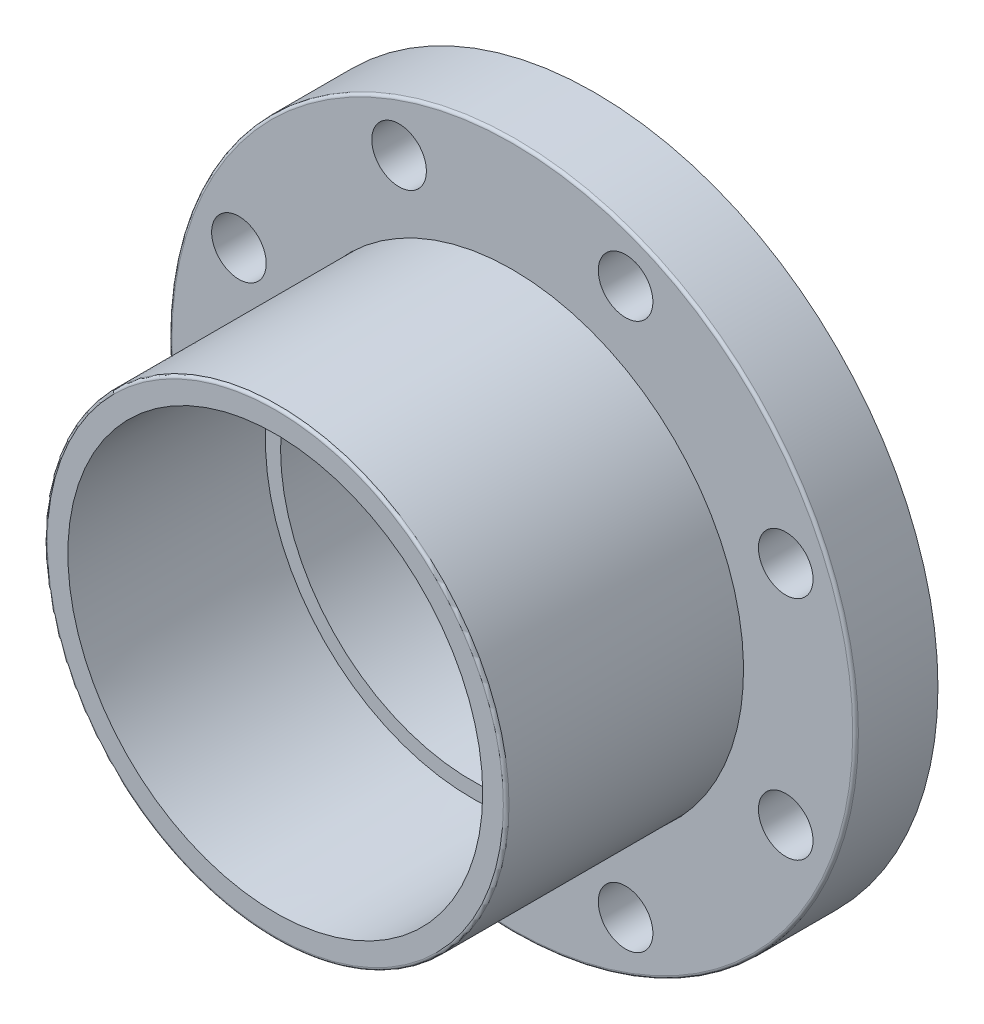
ISO-10303-21;
HEADER;
FILE_DESCRIPTION(('STEP AP214'),'2;1');
FILE_NAME('part.step','',(''),(''),'','','');
FILE_SCHEMA(('AUTOMOTIVE_DESIGN { 1 0 10303 214 1 1 1 1 }'));
ENDSEC;
DATA;
#1=APPLICATION_CONTEXT('core data for automotive mechanical design processes');
#2=APPLICATION_PROTOCOL_DEFINITION('international standard','automotive_design',2000,#1);
#3=PRODUCT_CONTEXT('',#1,'mechanical');
#4=PRODUCT('Part','Part','',(#3));
#5=PRODUCT_RELATED_PRODUCT_CATEGORY('part','',(#4));
#6=PRODUCT_DEFINITION_FORMATION('','',#4);
#7=PRODUCT_DEFINITION_CONTEXT('part definition',#1,'design');
#8=PRODUCT_DEFINITION('design','',#6,#7);
#9=PRODUCT_DEFINITION_SHAPE('','',#8);
#10=(LENGTH_UNIT() NAMED_UNIT(*) SI_UNIT(.MILLI.,.METRE.));
#11=(NAMED_UNIT(*) PLANE_ANGLE_UNIT() SI_UNIT($,.RADIAN.));
#12=(NAMED_UNIT(*) SI_UNIT($,.STERADIAN.) SOLID_ANGLE_UNIT());
#13=UNCERTAINTY_MEASURE_WITH_UNIT(LENGTH_MEASURE(1.E-05),#10,'distance_accuracy_value','');
#14=(GEOMETRIC_REPRESENTATION_CONTEXT(3) GLOBAL_UNCERTAINTY_ASSIGNED_CONTEXT((#13)) GLOBAL_UNIT_ASSIGNED_CONTEXT((#10,
#11,#12)) REPRESENTATION_CONTEXT('',''));
#15=CARTESIAN_POINT('',(0.,0.,0.));
#16=DIRECTION('',(0.,0.,1.));
#17=DIRECTION('',(1.,0.,0.));
#18=AXIS2_PLACEMENT_3D('',#15,#16,#17);
#19=CARTESIAN_POINT('',(0.,0.,0.));
#20=DIRECTION('',(0.,0.,-1.));
#21=DIRECTION('',(0.,1.,0.));
#22=AXIS2_PLACEMENT_3D('',#19,#20,#21);
#23=CYLINDRICAL_SURFACE('',#22,94.107);
#24=CARTESIAN_POINT('',(0.,0.,16.0597272727273));
#25=DIRECTION('',(0.,0.,-1.));
#26=DIRECTION('',(0.,1.,0.));
#27=AXIS2_PLACEMENT_3D('',#24,#25,#26);
#28=CIRCLE('',#27,94.107);
#29=CARTESIAN_POINT('',(0.,94.107,16.0597272727273));
#30=VERTEX_POINT('',#29);
#31=EDGE_CURVE('E63',#30,#30,#28,.T.);
#32=ORIENTED_EDGE('',*,*,#31,.T.);
#33=EDGE_LOOP('',(#32));
#34=FACE_BOUND('',#33,.T.);
#35=CARTESIAN_POINT('',(0.,0.,33.528));
#36=DIRECTION('',(0.,0.,-1.));
#37=DIRECTION('',(0.,1.,0.));
#38=AXIS2_PLACEMENT_3D('',#35,#36,#37);
#39=CIRCLE('',#38,94.107);
#40=CARTESIAN_POINT('',(0.,94.107,33.528));
#41=VERTEX_POINT('',#40);
#42=EDGE_CURVE('E58',#41,#41,#39,.T.);
#43=ORIENTED_EDGE('',*,*,#42,.F.);
#44=EDGE_LOOP('',(#43));
#45=FACE_BOUND('',#44,.T.);
#46=ADVANCED_FACE('F40',(#34,#45),#23,.F.);
#47=CARTESIAN_POINT('',(0.,93.98,16.0597272727273));
#48=DIRECTION('',(0.,0.,1.));
#49=DIRECTION('',(0.,-1.,0.));
#50=AXIS2_PLACEMENT_3D('',#47,#48,#49);
#51=PLANE('',#50);
#52=CARTESIAN_POINT('',(0.,0.,16.0597272727273));
#53=DIRECTION('',(0.,0.,-1.));
#54=DIRECTION('',(0.,1.,0.));
#55=AXIS2_PLACEMENT_3D('',#52,#53,#54);
#56=CIRCLE('',#55,82.9720098336647);
#57=CARTESIAN_POINT('',(0.,82.9720098336647,16.0597272727273));
#58=VERTEX_POINT('',#57);
#59=EDGE_CURVE('E65',#58,#58,#56,.T.);
#60=ORIENTED_EDGE('',*,*,#59,.T.);
#61=EDGE_LOOP('',(#60));
#62=FACE_BOUND('',#61,.T.);
#63=ORIENTED_EDGE('',*,*,#31,.F.);
#64=EDGE_LOOP('',(#63));
#65=FACE_BOUND('',#64,.T.);
#66=ADVANCED_FACE('F145',(#62,#65),#51,.T.);
#67=CARTESIAN_POINT('',(0.,0.,0.));
#68=DIRECTION('',(0.,0.,-1.));
#69=DIRECTION('',(0.,1.,0.));
#70=AXIS2_PLACEMENT_3D('',#67,#68,#69);
#71=CYLINDRICAL_SURFACE('',#70,82.9720098336647);
#72=CARTESIAN_POINT('',(0.,0.,0.));
#73=DIRECTION('',(0.,0.,-1.));
#74=DIRECTION('',(0.,1.,0.));
#75=AXIS2_PLACEMENT_3D('',#72,#73,#74);
#76=CIRCLE('',#75,82.9720098336647);
#77=CARTESIAN_POINT('',(0.,82.9720098336647,0.));
#78=VERTEX_POINT('',#77);
#79=EDGE_CURVE('E44',#78,#78,#76,.T.);
#80=ORIENTED_EDGE('',*,*,#79,.T.);
#81=EDGE_LOOP('',(#80));
#82=FACE_BOUND('',#81,.T.);
#83=ORIENTED_EDGE('',*,*,#59,.F.);
#84=EDGE_LOOP('',(#83));
#85=FACE_BOUND('',#84,.T.);
#86=ADVANCED_FACE('F131',(#82,#85),#71,.F.);
#87=CARTESIAN_POINT('',(0.,0.,32.3734545454545));
#88=DIRECTION('',(0.,0.,1.));
#89=DIRECTION('',(1.,0.,0.));
#90=AXIS2_PLACEMENT_3D('',#87,#88,#89);
#91=TOROIDAL_SURFACE('',#90,138.545454545455,1.15454545454545);
#92=CARTESIAN_POINT('',(0.,0.,32.3734545454545));
#93=DIRECTION('',(0.,0.,1.));
#94=DIRECTION('',(1.,0.,0.));
#95=AXIS2_PLACEMENT_3D('',#92,#93,#94);
#96=CIRCLE('',#95,139.7);
#97=CARTESIAN_POINT('',(139.7,0.,32.3734545454545));
#98=VERTEX_POINT('',#97);
#99=EDGE_CURVE('E116',#98,#98,#96,.F.);
#100=ORIENTED_EDGE('',*,*,#99,.F.);
#101=EDGE_LOOP('',(#100));
#102=FACE_BOUND('',#101,.T.);
#103=CARTESIAN_POINT('',(0.,0.,33.528));
#104=DIRECTION('',(0.,0.,1.));
#105=DIRECTION('',(1.,0.,0.));
#106=AXIS2_PLACEMENT_3D('',#103,#104,#105);
#107=CIRCLE('',#106,138.545454545455);
#108=CARTESIAN_POINT('',(138.545454545455,0.,33.528));
#109=VERTEX_POINT('',#108);
#110=EDGE_CURVE('E62',#109,#109,#107,.T.);
#111=ORIENTED_EDGE('',*,*,#110,.F.);
#112=EDGE_LOOP('',(#111));
#113=FACE_BOUND('',#112,.T.);
#114=ADVANCED_FACE('F127',(#102,#113),#91,.T.);
#115=CARTESIAN_POINT('',(46.0905806557781,111.272504916832,0.));
#116=DIRECTION('',(0.,0.,1.));
#117=DIRECTION('',(1.,0.,0.));
#118=AXIS2_PLACEMENT_3D('',#115,#116,#117);
#119=CYLINDRICAL_SURFACE('',#118,11.1125);
#120=CARTESIAN_POINT('',(46.0905806557781,111.272504916832,0.));
#121=DIRECTION('',(0.,0.,1.));
#122=DIRECTION('',(0.707106781186556,-0.707106781186539,0.));
#123=AXIS2_PLACEMENT_3D('',#120,#121,#122);
#124=CIRCLE('',#123,11.1125);
#125=CARTESIAN_POINT('',(53.9483047617137,103.414780810897,0.));
#126=VERTEX_POINT('',#125);
#127=EDGE_CURVE('E11',#126,#126,#124,.T.);
#128=ORIENTED_EDGE('',*,*,#127,.F.);
#129=EDGE_LOOP('',(#128));
#130=FACE_BOUND('',#129,.T.);
#131=CARTESIAN_POINT('',(46.0905806557781,111.272504916832,33.528));
#132=DIRECTION('',(0.,0.,1.));
#133=DIRECTION('',(0.707106781186556,-0.707106781186539,0.));
#134=AXIS2_PLACEMENT_3D('',#131,#132,#133);
#135=CIRCLE('',#134,11.1125);
#136=CARTESIAN_POINT('',(53.9483047617137,103.414780810897,33.528));
#137=VERTEX_POINT('',#136);
#138=EDGE_CURVE('E57',#137,#137,#135,.T.);
#139=ORIENTED_EDGE('',*,*,#138,.T.);
#140=EDGE_LOOP('',(#139));
#141=FACE_BOUND('',#140,.T.);
#142=ADVANCED_FACE('F130',(#130,#141),#119,.F.);
#143=CARTESIAN_POINT('',(111.272504916832,46.0905806557792,0.));
#144=DIRECTION('',(0.,0.,1.));
#145=DIRECTION('',(1.,0.,0.));
#146=AXIS2_PLACEMENT_3D('',#143,#144,#145);
#147=CYLINDRICAL_SURFACE('',#146,11.1125);
#148=CARTESIAN_POINT('',(111.272504916832,46.0905806557792,0.));
#149=DIRECTION('',(0.,0.,1.));
#150=DIRECTION('',(0.,-1.,0.));
#151=AXIS2_PLACEMENT_3D('',#148,#149,#150);
#152=CIRCLE('',#151,11.1125);
#153=CARTESIAN_POINT('',(111.272504916832,34.9780806557792,0.));
#154=VERTEX_POINT('',#153);
#155=EDGE_CURVE('E48',#154,#154,#152,.T.);
#156=ORIENTED_EDGE('',*,*,#155,.F.);
#157=EDGE_LOOP('',(#156));
#158=FACE_BOUND('',#157,.T.);
#159=CARTESIAN_POINT('',(111.272504916832,46.0905806557792,33.528));
#160=DIRECTION('',(0.,0.,1.));
#161=DIRECTION('',(0.,-1.,0.));
#162=AXIS2_PLACEMENT_3D('',#159,#160,#161);
#163=CIRCLE('',#162,11.1125);
#164=CARTESIAN_POINT('',(111.272504916832,34.9780806557792,33.528));
#165=VERTEX_POINT('',#164);
#166=EDGE_CURVE('E73',#165,#165,#163,.T.);
#167=ORIENTED_EDGE('',*,*,#166,.T.);
#168=EDGE_LOOP('',(#167));
#169=FACE_BOUND('',#168,.T.);
#170=ADVANCED_FACE('F171',(#158,#169),#147,.F.);
#171=CARTESIAN_POINT('',(111.272504916832,-46.0905806557785,0.));
#172=DIRECTION('',(0.,0.,1.));
#173=DIRECTION('',(1.,0.,0.));
#174=AXIS2_PLACEMENT_3D('',#171,#172,#173);
#175=CYLINDRICAL_SURFACE('',#174,11.1125);
#176=CARTESIAN_POINT('',(111.272504916832,-46.0905806557785,0.));
#177=DIRECTION('',(0.,0.,1.));
#178=DIRECTION('',(-0.707106781186541,-0.707106781186554,0.));
#179=AXIS2_PLACEMENT_3D('',#176,#177,#178);
#180=CIRCLE('',#179,11.1125);
#181=CARTESIAN_POINT('',(103.414780810897,-53.948304761714,0.));
#182=VERTEX_POINT('',#181);
#183=EDGE_CURVE('E53',#182,#182,#180,.T.);
#184=ORIENTED_EDGE('',*,*,#183,.F.);
#185=EDGE_LOOP('',(#184));
#186=FACE_BOUND('',#185,.T.);
#187=CARTESIAN_POINT('',(111.272504916832,-46.0905806557785,33.528));
#188=DIRECTION('',(0.,0.,1.));
#189=DIRECTION('',(-0.707106781186541,-0.707106781186554,0.));
#190=AXIS2_PLACEMENT_3D('',#187,#188,#189);
#191=CIRCLE('',#190,11.1125);
#192=CARTESIAN_POINT('',(103.414780810897,-53.948304761714,33.528));
#193=VERTEX_POINT('',#192);
#194=EDGE_CURVE('E77',#193,#193,#191,.T.);
#195=ORIENTED_EDGE('',*,*,#194,.T.);
#196=EDGE_LOOP('',(#195));
#197=FACE_BOUND('',#196,.T.);
#198=ADVANCED_FACE('F178',(#186,#197),#175,.F.);
#199=CARTESIAN_POINT('',(46.0905806557788,-111.272504916832,0.));
#200=DIRECTION('',(0.,0.,1.));
#201=DIRECTION('',(1.,0.,0.));
#202=AXIS2_PLACEMENT_3D('',#199,#200,#201);
#203=CYLINDRICAL_SURFACE('',#202,11.1125);
#204=CARTESIAN_POINT('',(46.0905806557788,-111.272504916832,0.));
#205=DIRECTION('',(0.,0.,1.));
#206=DIRECTION('',(-1.,0.,0.));
#207=AXIS2_PLACEMENT_3D('',#204,#205,#206);
#208=CIRCLE('',#207,11.1125);
#209=CARTESIAN_POINT('',(34.9780806557788,-111.272504916832,0.));
#210=VERTEX_POINT('',#209);
#211=EDGE_CURVE('E86',#210,#210,#208,.T.);
#212=ORIENTED_EDGE('',*,*,#211,.F.);
#213=EDGE_LOOP('',(#212));
#214=FACE_BOUND('',#213,.T.);
#215=CARTESIAN_POINT('',(46.0905806557788,-111.272504916832,33.528));
#216=DIRECTION('',(0.,0.,1.));
#217=DIRECTION('',(-1.,0.,0.));
#218=AXIS2_PLACEMENT_3D('',#215,#216,#217);
#219=CIRCLE('',#218,11.1125);
#220=CARTESIAN_POINT('',(34.9780806557788,-111.272504916832,33.528));
#221=VERTEX_POINT('',#220);
#222=EDGE_CURVE('E82',#221,#221,#219,.T.);
#223=ORIENTED_EDGE('',*,*,#222,.T.);
#224=EDGE_LOOP('',(#223));
#225=FACE_BOUND('',#224,.T.);
#226=ADVANCED_FACE('F185',(#214,#225),#203,.F.);
#227=CARTESIAN_POINT('',(-46.0905806557788,-111.272504916832,0.));
#228=DIRECTION('',(0.,0.,1.));
#229=DIRECTION('',(1.,0.,0.));
#230=AXIS2_PLACEMENT_3D('',#227,#228,#229);
#231=CYLINDRICAL_SURFACE('',#230,11.1125);
#232=CARTESIAN_POINT('',(-46.0905806557788,-111.272504916832,0.));
#233=DIRECTION('',(0.,0.,1.));
#234=DIRECTION('',(-0.707106781186551,0.707106781186544,0.));
#235=AXIS2_PLACEMENT_3D('',#232,#233,#234);
#236=CIRCLE('',#235,11.1125);
#237=CARTESIAN_POINT('',(-53.9483047617144,-103.414780810897,0.));
#238=VERTEX_POINT('',#237);
#239=EDGE_CURVE('E90',#238,#238,#236,.T.);
#240=ORIENTED_EDGE('',*,*,#239,.F.);
#241=EDGE_LOOP('',(#240));
#242=FACE_BOUND('',#241,.T.);
#243=CARTESIAN_POINT('',(-46.0905806557788,-111.272504916832,33.528));
#244=DIRECTION('',(0.,0.,1.));
#245=DIRECTION('',(-0.707106781186551,0.707106781186544,0.));
#246=AXIS2_PLACEMENT_3D('',#243,#244,#245);
#247=CIRCLE('',#246,11.1125);
#248=CARTESIAN_POINT('',(-53.9483047617144,-103.414780810897,33.528));
#249=VERTEX_POINT('',#248);
#250=EDGE_CURVE('E93',#249,#249,#247,.T.);
#251=ORIENTED_EDGE('',*,*,#250,.T.);
#252=EDGE_LOOP('',(#251));
#253=FACE_BOUND('',#252,.T.);
#254=ADVANCED_FACE('F193',(#242,#253),#231,.F.);
#255=CARTESIAN_POINT('',(-111.272504916832,-46.0905806557784,0.));
#256=DIRECTION('',(0.,0.,1.));
#257=DIRECTION('',(1.,0.,0.));
#258=AXIS2_PLACEMENT_3D('',#255,#256,#257);
#259=CYLINDRICAL_SURFACE('',#258,11.1125);
#260=CARTESIAN_POINT('',(-111.272504916832,-46.0905806557784,0.));
#261=DIRECTION('',(0.,0.,1.));
#262=DIRECTION('',(0.,1.,0.));
#263=AXIS2_PLACEMENT_3D('',#260,#261,#262);
#264=CIRCLE('',#263,11.1125);
#265=CARTESIAN_POINT('',(-111.272504916832,-34.9780806557784,0.));
#266=VERTEX_POINT('',#265);
#267=EDGE_CURVE('E96',#266,#266,#264,.T.);
#268=ORIENTED_EDGE('',*,*,#267,.F.);
#269=EDGE_LOOP('',(#268));
#270=FACE_BOUND('',#269,.T.);
#271=CARTESIAN_POINT('',(-111.272504916832,-46.0905806557784,33.528));
#272=DIRECTION('',(0.,0.,1.));
#273=DIRECTION('',(0.,1.,0.));
#274=AXIS2_PLACEMENT_3D('',#271,#272,#273);
#275=CIRCLE('',#274,11.1125);
#276=CARTESIAN_POINT('',(-111.272504916832,-34.9780806557784,33.528));
#277=VERTEX_POINT('',#276);
#278=EDGE_CURVE('E99',#277,#277,#275,.T.);
#279=ORIENTED_EDGE('',*,*,#278,.T.);
#280=EDGE_LOOP('',(#279));
#281=FACE_BOUND('',#280,.T.);
#282=ADVANCED_FACE('F202',(#270,#281),#259,.F.);
#283=CARTESIAN_POINT('',(-111.272504916832,46.0905806557792,0.));
#284=DIRECTION('',(0.,0.,1.));
#285=DIRECTION('',(1.,0.,0.));
#286=AXIS2_PLACEMENT_3D('',#283,#284,#285);
#287=CYLINDRICAL_SURFACE('',#286,11.1125);
#288=CARTESIAN_POINT('',(-111.272504916832,46.0905806557792,0.));
#289=DIRECTION('',(0.,0.,1.));
#290=DIRECTION('',(0.707106781186546,0.707106781186549,0.));
#291=AXIS2_PLACEMENT_3D('',#288,#289,#290);
#292=CIRCLE('',#291,11.1125);
#293=CARTESIAN_POINT('',(-103.414780810896,53.9483047617148,0.));
#294=VERTEX_POINT('',#293);
#295=EDGE_CURVE('E102',#294,#294,#292,.T.);
#296=ORIENTED_EDGE('',*,*,#295,.F.);
#297=EDGE_LOOP('',(#296));
#298=FACE_BOUND('',#297,.T.);
#299=CARTESIAN_POINT('',(-111.272504916832,46.0905806557792,33.528));
#300=DIRECTION('',(0.,0.,1.));
#301=DIRECTION('',(0.707106781186546,0.707106781186549,0.));
#302=AXIS2_PLACEMENT_3D('',#299,#300,#301);
#303=CIRCLE('',#302,11.1125);
#304=CARTESIAN_POINT('',(-103.414780810896,53.9483047617148,33.528));
#305=VERTEX_POINT('',#304);
#306=EDGE_CURVE('E105',#305,#305,#303,.T.);
#307=ORIENTED_EDGE('',*,*,#306,.T.);
#308=EDGE_LOOP('',(#307));
#309=FACE_BOUND('',#308,.T.);
#310=ADVANCED_FACE('F139',(#298,#309),#287,.F.);
#311=CARTESIAN_POINT('',(0.,0.,33.528));
#312=DIRECTION('',(0.,0.,1.));
#313=DIRECTION('',(1.,0.,0.));
#314=AXIS2_PLACEMENT_3D('',#311,#312,#313);
#315=PLANE('',#314);
#316=CARTESIAN_POINT('',(-46.090580655778,111.272504916832,33.528));
#317=DIRECTION('',(0.,0.,1.));
#318=DIRECTION('',(1.,0.,0.));
#319=AXIS2_PLACEMENT_3D('',#316,#317,#318);
#320=CIRCLE('',#319,11.1125);
#321=CARTESIAN_POINT('',(-34.978080655778,111.272504916832,33.528));
#322=VERTEX_POINT('',#321);
#323=EDGE_CURVE('E61',#322,#322,#320,.T.);
#324=ORIENTED_EDGE('',*,*,#323,.F.);
#325=EDGE_LOOP('',(#324));
#326=FACE_BOUND('',#325,.T.);
#327=ORIENTED_EDGE('',*,*,#306,.F.);
#328=EDGE_LOOP('',(#327));
#329=FACE_BOUND('',#328,.T.);
#330=ORIENTED_EDGE('',*,*,#278,.F.);
#331=EDGE_LOOP('',(#330));
#332=FACE_BOUND('',#331,.T.);
#333=ORIENTED_EDGE('',*,*,#250,.F.);
#334=EDGE_LOOP('',(#333));
#335=FACE_BOUND('',#334,.T.);
#336=ORIENTED_EDGE('',*,*,#222,.F.);
#337=EDGE_LOOP('',(#336));
#338=FACE_BOUND('',#337,.T.);
#339=ORIENTED_EDGE('',*,*,#194,.F.);
#340=EDGE_LOOP('',(#339));
#341=FACE_BOUND('',#340,.T.);
#342=ORIENTED_EDGE('',*,*,#166,.F.);
#343=EDGE_LOOP('',(#342));
#344=FACE_BOUND('',#343,.T.);
#345=ORIENTED_EDGE('',*,*,#138,.F.);
#346=EDGE_LOOP('',(#345));
#347=FACE_BOUND('',#346,.T.);
#348=ORIENTED_EDGE('',*,*,#110,.T.);
#349=EDGE_LOOP('',(#348));
#350=FACE_BOUND('',#349,.T.);
#351=ORIENTED_EDGE('',*,*,#42,.T.);
#352=EDGE_LOOP('',(#351));
#353=FACE_BOUND('',#352,.T.);
#354=ADVANCED_FACE('F135',(#326,#329,#332,#335,#338,#341,#344,#347,#350,#353),#315,.T.);
#355=CARTESIAN_POINT('',(-46.090580655778,111.272504916832,0.));
#356=DIRECTION('',(0.,0.,1.));
#357=DIRECTION('',(1.,0.,0.));
#358=AXIS2_PLACEMENT_3D('',#355,#356,#357);
#359=CYLINDRICAL_SURFACE('',#358,11.1125);
#360=CARTESIAN_POINT('',(-46.090580655778,111.272504916832,0.));
#361=DIRECTION('',(0.,0.,1.));
#362=DIRECTION('',(1.,0.,0.));
#363=AXIS2_PLACEMENT_3D('',#360,#361,#362);
#364=CIRCLE('',#363,11.1125);
#365=CARTESIAN_POINT('',(-34.978080655778,111.272504916832,0.));
#366=VERTEX_POINT('',#365);
#367=EDGE_CURVE('E108',#366,#366,#364,.T.);
#368=ORIENTED_EDGE('',*,*,#367,.F.);
#369=EDGE_LOOP('',(#368));
#370=FACE_BOUND('',#369,.T.);
#371=ORIENTED_EDGE('',*,*,#323,.T.);
#372=EDGE_LOOP('',(#371));
#373=FACE_BOUND('',#372,.T.);
#374=ADVANCED_FACE('F138',(#370,#373),#359,.F.);
#375=CARTESIAN_POINT('',(0.,0.,33.528));
#376=DIRECTION('',(0.,0.,-1.));
#377=DIRECTION('',(-1.,0.,0.));
#378=AXIS2_PLACEMENT_3D('',#375,#376,#377);
#379=CYLINDRICAL_SURFACE('',#378,139.7);
#380=ORIENTED_EDGE('',*,*,#99,.T.);
#381=EDGE_LOOP('',(#380));
#382=FACE_BOUND('',#381,.T.);
#383=CARTESIAN_POINT('',(0.,0.,0.));
#384=DIRECTION('',(0.,0.,1.));
#385=DIRECTION('',(1.,0.,0.));
#386=AXIS2_PLACEMENT_3D('',#383,#384,#385);
#387=CIRCLE('',#386,139.7);
#388=CARTESIAN_POINT('',(139.7,0.,0.));
#389=VERTEX_POINT('',#388);
#390=EDGE_CURVE('E113',#389,#389,#387,.T.);
#391=ORIENTED_EDGE('',*,*,#390,.T.);
#392=EDGE_LOOP('',(#391));
#393=FACE_BOUND('',#392,.T.);
#394=ADVANCED_FACE('F124',(#382,#393),#379,.T.);
#395=CARTESIAN_POINT('',(0.,0.,0.));
#396=DIRECTION('',(0.,0.,1.));
#397=DIRECTION('',(1.,0.,0.));
#398=AXIS2_PLACEMENT_3D('',#395,#396,#397);
#399=PLANE('',#398);
#400=ORIENTED_EDGE('',*,*,#390,.F.);
#401=EDGE_LOOP('',(#400));
#402=FACE_BOUND('',#401,.T.);
#403=ORIENTED_EDGE('',*,*,#367,.T.);
#404=EDGE_LOOP('',(#403));
#405=FACE_BOUND('',#404,.T.);
#406=ORIENTED_EDGE('',*,*,#295,.T.);
#407=EDGE_LOOP('',(#406));
#408=FACE_BOUND('',#407,.T.);
#409=ORIENTED_EDGE('',*,*,#267,.T.);
#410=EDGE_LOOP('',(#409));
#411=FACE_BOUND('',#410,.T.);
#412=ORIENTED_EDGE('',*,*,#239,.T.);
#413=EDGE_LOOP('',(#412));
#414=FACE_BOUND('',#413,.T.);
#415=ORIENTED_EDGE('',*,*,#211,.T.);
#416=EDGE_LOOP('',(#415));
#417=FACE_BOUND('',#416,.T.);
#418=ORIENTED_EDGE('',*,*,#183,.T.);
#419=EDGE_LOOP('',(#418));
#420=FACE_BOUND('',#419,.T.);
#421=ORIENTED_EDGE('',*,*,#155,.T.);
#422=EDGE_LOOP('',(#421));
#423=FACE_BOUND('',#422,.T.);
#424=ORIENTED_EDGE('',*,*,#127,.T.);
#425=EDGE_LOOP('',(#424));
#426=FACE_BOUND('',#425,.T.);
#427=ORIENTED_EDGE('',*,*,#79,.F.);
#428=EDGE_LOOP('',(#427));
#429=FACE_BOUND('',#428,.T.);
#430=ADVANCED_FACE('F42',(#402,#405,#408,#411,#414,#417,#420,#423,#426,#429),#399,.F.);
#431=CLOSED_SHELL('',(#46,#66,#86,#114,#142,#170,#198,#226,#254,#282,#310,#354,#374,#394,#430));
#432=MANIFOLD_SOLID_BREP('B2',#431);
#433=CARTESIAN_POINT('',(0.,0.,0.));
#434=DIRECTION('',(0.,0.,1.));
#435=DIRECTION('',(1.,0.,0.));
#436=AXIS2_PLACEMENT_3D('',#433,#434,#435);
#437=PLANE('',#436);
#438=CARTESIAN_POINT('',(0.,0.,0.));
#439=DIRECTION('',(0.,0.,-1.));
#440=DIRECTION('',(0.,1.,0.));
#441=AXIS2_PLACEMENT_3D('',#438,#439,#440);
#442=CIRCLE('',#441,82.8450098336647);
#443=CARTESIAN_POINT('',(0.,82.8450098336647,0.));
#444=VERTEX_POINT('',#443);
#445=EDGE_CURVE('E371',#444,#444,#442,.T.);
#446=ORIENTED_EDGE('',*,*,#445,.T.);
#447=EDGE_LOOP('',(#446));
#448=FACE_BOUND('',#447,.T.);
#449=CARTESIAN_POINT('',(0.,0.,0.));
#450=DIRECTION('',(0.,0.,1.));
#451=DIRECTION('',(1.,0.,0.));
#452=AXIS2_PLACEMENT_3D('',#449,#450,#451);
#453=CIRCLE('',#452,77.851);
#454=CARTESIAN_POINT('',(77.851,0.,0.));
#455=VERTEX_POINT('',#454);
#456=EDGE_CURVE('E354',#455,#455,#453,.T.);
#457=ORIENTED_EDGE('',*,*,#456,.T.);
#458=EDGE_LOOP('',(#457));
#459=FACE_BOUND('',#458,.T.);
#460=ADVANCED_FACE('F339',(#448,#459),#437,.F.);
#461=CARTESIAN_POINT('',(0.,0.,130.));
#462=DIRECTION('',(0.,0.,-1.));
#463=DIRECTION('',(-1.,0.,0.));
#464=AXIS2_PLACEMENT_3D('',#461,#462,#463);
#465=CYLINDRICAL_SURFACE('',#464,93.98);
#466=CARTESIAN_POINT('',(0.,0.,128.845454545455));
#467=DIRECTION('',(0.,0.,1.));
#468=DIRECTION('',(1.,0.,0.));
#469=AXIS2_PLACEMENT_3D('',#466,#467,#468);
#470=CIRCLE('',#469,93.98);
#471=CARTESIAN_POINT('',(-93.98,0.,128.845454545455));
#472=VERTEX_POINT('',#471);
#473=EDGE_CURVE('E39',#472,#472,#470,.F.);
#474=CARTESIAN_POINT('',(0.,0.,16.1867272727273));
#475=DIRECTION('',(0.,0.,-1.));
#476=DIRECTION('',(0.,1.,0.));
#477=AXIS2_PLACEMENT_3D('',#474,#475,#476);
#478=CIRCLE('',#477,93.98);
#479=CARTESIAN_POINT('',(-93.98,0.,16.1867272727273));
#480=VERTEX_POINT('',#479);
#481=EDGE_CURVE('E368',#480,#480,#478,.T.);
#482=CARTESIAN_POINT('',(-93.98,0.,128.845454545455));
#483=CARTESIAN_POINT('',(-93.98,0.,127.671926136364));
#484=CARTESIAN_POINT('',(-93.98,0.,126.498397727273));
#485=CARTESIAN_POINT('',(-93.98,0.,124.151340909091));
#486=CARTESIAN_POINT('',(-93.98,0.,122.9778125));
#487=CARTESIAN_POINT('',(-93.98,0.,120.630755681818));
#488=CARTESIAN_POINT('',(-93.98,0.,119.457227272727));
#489=CARTESIAN_POINT('',(-93.98,0.,117.110170454545));
#490=CARTESIAN_POINT('',(-93.98,0.,115.936642045455));
#491=CARTESIAN_POINT('',(-93.98,0.,113.589585227273));
#492=CARTESIAN_POINT('',(-93.98,0.,112.416056818182));
#493=CARTESIAN_POINT('',(-93.98,0.,110.069));
#494=CARTESIAN_POINT('',(-93.98,0.,108.895471590909));
#495=CARTESIAN_POINT('',(-93.98,0.,106.548414772727));
#496=CARTESIAN_POINT('',(-93.98,0.,105.374886363636));
#497=CARTESIAN_POINT('',(-93.98,0.,103.027829545455));
#498=CARTESIAN_POINT('',(-93.98,0.,101.854301136364));
#499=CARTESIAN_POINT('',(-93.98,0.,99.5072443181818));
#500=CARTESIAN_POINT('',(-93.98,0.,98.3337159090909));
#501=CARTESIAN_POINT('',(-93.98,0.,95.9866590909091));
#502=CARTESIAN_POINT('',(-93.98,0.,94.8131306818182));
#503=CARTESIAN_POINT('',(-93.98,0.,92.4660738636364));
#504=CARTESIAN_POINT('',(-93.98,0.,91.2925454545454));
#505=CARTESIAN_POINT('',(-93.98,0.,88.9454886363636));
#506=CARTESIAN_POINT('',(-93.98,0.,87.7719602272727));
#507=CARTESIAN_POINT('',(-93.98,0.,85.4249034090909));
#508=CARTESIAN_POINT('',(-93.98,0.,84.251375));
#509=CARTESIAN_POINT('',(-93.98,0.,81.9043181818182));
#510=CARTESIAN_POINT('',(-93.98,0.,80.7307897727272));
#511=CARTESIAN_POINT('',(-93.98,0.,78.3837329545454));
#512=CARTESIAN_POINT('',(-93.98,0.,77.2102045454545));
#513=CARTESIAN_POINT('',(-93.98,0.,74.8631477272727));
#514=CARTESIAN_POINT('',(-93.98,0.,73.6896193181818));
#515=CARTESIAN_POINT('',(-93.98,0.,71.3425625));
#516=CARTESIAN_POINT('',(-93.98,0.,70.1690340909091));
#517=CARTESIAN_POINT('',(-93.98,0.,67.8219772727273));
#518=CARTESIAN_POINT('',(-93.98,0.,66.6484488636364));
#519=CARTESIAN_POINT('',(-93.98,0.,64.3013920454545));
#520=CARTESIAN_POINT('',(-93.98,0.,63.1278636363636));
#521=CARTESIAN_POINT('',(-93.98,0.,60.7808068181818));
#522=CARTESIAN_POINT('',(-93.98,0.,59.6072784090909));
#523=CARTESIAN_POINT('',(-93.98,0.,57.2602215909091));
#524=CARTESIAN_POINT('',(-93.98,0.,56.0866931818182));
#525=CARTESIAN_POINT('',(-93.98,0.,53.7396363636364));
#526=CARTESIAN_POINT('',(-93.98,0.,52.5661079545454));
#527=CARTESIAN_POINT('',(-93.98,0.,50.2190511363636));
#528=CARTESIAN_POINT('',(-93.98,0.,49.0455227272727));
#529=CARTESIAN_POINT('',(-93.98,0.,46.6984659090909));
#530=CARTESIAN_POINT('',(-93.98,0.,45.5249375));
#531=CARTESIAN_POINT('',(-93.98,0.,43.1778806818182));
#532=CARTESIAN_POINT('',(-93.98,0.,42.0043522727273));
#533=CARTESIAN_POINT('',(-93.98,0.,39.6572954545454));
#534=CARTESIAN_POINT('',(-93.98,0.,38.4837670454545));
#535=CARTESIAN_POINT('',(-93.98,0.,36.1367102272727));
#536=CARTESIAN_POINT('',(-93.98,0.,34.9631818181818));
#537=CARTESIAN_POINT('',(-93.98,0.,32.616125));
#538=CARTESIAN_POINT('',(-93.98,0.,31.4425965909091));
#539=CARTESIAN_POINT('',(-93.98,0.,29.0955397727273));
#540=CARTESIAN_POINT('',(-93.98,0.,27.9220113636363));
#541=CARTESIAN_POINT('',(-93.98,0.,25.5749545454545));
#542=CARTESIAN_POINT('',(-93.98,0.,24.4014261363636));
#543=CARTESIAN_POINT('',(-93.98,0.,22.0543693181818));
#544=CARTESIAN_POINT('',(-93.98,0.,20.8808409090909));
#545=CARTESIAN_POINT('',(-93.98,0.,18.5337840909091));
#546=CARTESIAN_POINT('',(-93.98,0.,17.3602556818182));
#547=CARTESIAN_POINT('',(-93.98,0.,16.1867272727273));
#548=B_SPLINE_CURVE_WITH_KNOTS('',3,(#482,#483,#484,#485,#486,#487,#488,#489,#490,#491,#492,
#493,#494,#495,#496,#497,#498,#499,#500,#501,#502,#503,#504,#505,#506,#507,#508,#509,#510,#511,
#512,#513,#514,#515,#516,#517,#518,#519,#520,#521,#522,#523,#524,#525,#526,#527,#528,#529,#530,
#531,#532,#533,#534,#535,#536,#537,#538,#539,#540,#541,#542,#543,#544,#545,#546,#547),
.UNSPECIFIED.,.F.,.F.,(4,2,2,2,2,2,2,2,2,2,2,2,2,2,2,2,2,2,2,2,2,2,2,2,2,2,2,2,2,2,2,2,4),(0.,
3.52058522727272,7.04117045454544,10.5617556818182,14.0823409090909,17.6029261363636,
21.1235113636364,24.6440965909091,28.1646818181818,31.6852670454545,35.2058522727273,38.7264375,
42.2470227272727,45.7676079545454,49.2881931818182,52.8087784090909,56.3293636363636,
59.8499488636363,63.3705340909091,66.8911193181818,70.4117045454545,73.9322897727273,77.452875,
80.9734602272727,84.4940454545454,88.0146306818182,91.5352159090909,95.0558011363636,
98.5763863636363,102.096971590909,105.617556818182,109.138142045455,112.658727272727),.UNSPECIFIED.);
#549=EDGE_CURVE('BSEAM390',#472,#480,#548,.T.);
#550=ORIENTED_EDGE('',*,*,#473,.T.);
#551=ORIENTED_EDGE('',*,*,#481,.F.);
#552=ORIENTED_EDGE('',*,*,#549,.T.);
#553=ORIENTED_EDGE('',*,*,#549,.F.);
#554=EDGE_LOOP('',(#550,#552,#551,#553));
#555=FACE_BOUND('',#554,.T.);
#556=ADVANCED_FACE('F390',(#555),#465,.T.);
#557=CARTESIAN_POINT('',(0.,0.,130.));
#558=DIRECTION('',(0.,0.,1.));
#559=DIRECTION('',(1.,0.,0.));
#560=AXIS2_PLACEMENT_3D('',#557,#558,#559);
#561=PLANE('',#560);
#562=CARTESIAN_POINT('',(0.,0.,130.));
#563=DIRECTION('',(0.,0.,1.));
#564=DIRECTION('',(1.,0.,0.));
#565=AXIS2_PLACEMENT_3D('',#562,#563,#564);
#566=CIRCLE('',#565,84.4169);
#567=CARTESIAN_POINT('',(84.4169,0.,130.));
#568=VERTEX_POINT('',#567);
#569=EDGE_CURVE('E359',#568,#568,#566,.T.);
#570=ORIENTED_EDGE('',*,*,#569,.F.);
#571=EDGE_LOOP('',(#570));
#572=FACE_BOUND('',#571,.T.);
#573=CARTESIAN_POINT('',(0.,0.,130.));
#574=DIRECTION('',(0.,0.,1.));
#575=DIRECTION('',(1.,0.,0.));
#576=AXIS2_PLACEMENT_3D('',#573,#574,#575);
#577=CIRCLE('',#576,92.8254545454546);
#578=CARTESIAN_POINT('',(92.8254545454546,0.,130.));
#579=VERTEX_POINT('',#578);
#580=EDGE_CURVE('E346',#579,#579,#577,.T.);
#581=ORIENTED_EDGE('',*,*,#580,.T.);
#582=EDGE_LOOP('',(#581));
#583=FACE_BOUND('',#582,.T.);
#584=ADVANCED_FACE('F392',(#572,#583),#561,.T.);
#585=CARTESIAN_POINT('',(0.,0.,128.845454545455));
#586=DIRECTION('',(0.,0.,1.));
#587=DIRECTION('',(1.,0.,0.));
#588=AXIS2_PLACEMENT_3D('',#585,#586,#587);
#589=TOROIDAL_SURFACE('',#588,92.8254545454546,1.15454545454545);
#590=ORIENTED_EDGE('',*,*,#473,.F.);
#591=EDGE_LOOP('',(#590));
#592=FACE_BOUND('',#591,.T.);
#593=ORIENTED_EDGE('',*,*,#580,.F.);
#594=EDGE_LOOP('',(#593));
#595=FACE_BOUND('',#594,.T.);
#596=ADVANCED_FACE('F341',(#592,#595),#589,.T.);
#597=CARTESIAN_POINT('',(0.,77.851,50.));
#598=DIRECTION('',(0.,0.,-1.));
#599=DIRECTION('',(-1.,0.,0.));
#600=AXIS2_PLACEMENT_3D('',#597,#598,#599);
#601=PLANE('',#600);
#602=CARTESIAN_POINT('',(0.,0.,50.));
#603=DIRECTION('',(0.,0.,1.));
#604=DIRECTION('',(1.,0.,0.));
#605=AXIS2_PLACEMENT_3D('',#602,#603,#604);
#606=CIRCLE('',#605,77.851);
#607=CARTESIAN_POINT('',(77.851,0.,50.));
#608=VERTEX_POINT('',#607);
#609=EDGE_CURVE('E350',#608,#608,#606,.T.);
#610=ORIENTED_EDGE('',*,*,#609,.F.);
#611=EDGE_LOOP('',(#610));
#612=FACE_BOUND('',#611,.T.);
#613=CARTESIAN_POINT('',(0.,0.,50.));
#614=DIRECTION('',(0.,0.,1.));
#615=DIRECTION('',(1.,0.,0.));
#616=AXIS2_PLACEMENT_3D('',#613,#614,#615);
#617=CIRCLE('',#616,83.9978);
#618=CARTESIAN_POINT('',(83.9978,0.,50.));
#619=VERTEX_POINT('',#618);
#620=EDGE_CURVE('E362',#619,#619,#617,.T.);
#621=ORIENTED_EDGE('',*,*,#620,.T.);
#622=EDGE_LOOP('',(#621));
#623=FACE_BOUND('',#622,.T.);
#624=ADVANCED_FACE('F401',(#612,#623),#601,.F.);
#625=CARTESIAN_POINT('',(0.,0.,130.));
#626=DIRECTION('',(0.,0.,1.));
#627=DIRECTION('',(1.,0.,0.));
#628=AXIS2_PLACEMENT_3D('',#625,#626,#627);
#629=CYLINDRICAL_SURFACE('',#628,77.851);
#630=ORIENTED_EDGE('',*,*,#456,.F.);
#631=EDGE_LOOP('',(#630));
#632=FACE_BOUND('',#631,.T.);
#633=ORIENTED_EDGE('',*,*,#609,.T.);
#634=EDGE_LOOP('',(#633));
#635=FACE_BOUND('',#634,.T.);
#636=ADVANCED_FACE('F404',(#632,#635),#629,.F.);
#637=CARTESIAN_POINT('',(0.,0.,130.));
#638=DIRECTION('',(0.,0.,1.));
#639=DIRECTION('',(1.,0.,0.));
#640=AXIS2_PLACEMENT_3D('',#637,#638,#639);
#641=CONICAL_SURFACE('',#640,84.4169,0.00523870207582854);
#642=ORIENTED_EDGE('',*,*,#620,.F.);
#643=EDGE_LOOP('',(#642));
#644=FACE_BOUND('',#643,.T.);
#645=ORIENTED_EDGE('',*,*,#569,.T.);
#646=EDGE_LOOP('',(#645));
#647=FACE_BOUND('',#646,.T.);
#648=ADVANCED_FACE('F381',(#644,#647),#641,.F.);
#649=CARTESIAN_POINT('',(0.,0.,0.));
#650=DIRECTION('',(0.,0.,-1.));
#651=DIRECTION('',(0.,1.,0.));
#652=AXIS2_PLACEMENT_3D('',#649,#650,#651);
#653=CYLINDRICAL_SURFACE('',#652,82.8450098336647);
#654=ORIENTED_EDGE('',*,*,#445,.F.);
#655=EDGE_LOOP('',(#654));
#656=FACE_BOUND('',#655,.T.);
#657=CARTESIAN_POINT('',(0.,0.,16.1867272727273));
#658=DIRECTION('',(0.,0.,-1.));
#659=DIRECTION('',(0.,1.,0.));
#660=AXIS2_PLACEMENT_3D('',#657,#658,#659);
#661=CIRCLE('',#660,82.8450098336647);
#662=CARTESIAN_POINT('',(0.,82.8450098336647,16.1867272727273));
#663=VERTEX_POINT('',#662);
#664=EDGE_CURVE('E365',#663,#663,#661,.T.);
#665=ORIENTED_EDGE('',*,*,#664,.T.);
#666=EDGE_LOOP('',(#665));
#667=FACE_BOUND('',#666,.T.);
#668=ADVANCED_FACE('F377',(#656,#667),#653,.T.);
#669=CARTESIAN_POINT('',(0.,93.98,16.1867272727273));
#670=DIRECTION('',(0.,0.,1.));
#671=DIRECTION('',(0.,-1.,0.));
#672=AXIS2_PLACEMENT_3D('',#669,#670,#671);
#673=PLANE('',#672);
#674=ORIENTED_EDGE('',*,*,#664,.F.);
#675=EDGE_LOOP('',(#674));
#676=FACE_BOUND('',#675,.T.);
#677=ORIENTED_EDGE('',*,*,#481,.T.);
#678=EDGE_LOOP('',(#677));
#679=FACE_BOUND('',#678,.T.);
#680=ADVANCED_FACE('F380',(#676,#679),#673,.F.);
#681=CLOSED_SHELL('',(#460,#556,#584,#596,#624,#636,#648,#668,#680));
#682=MANIFOLD_SOLID_BREP('B6',#681);
#683=ADVANCED_BREP_SHAPE_REPRESENTATION('',(#18,#432,#682),#14);
#684=SHAPE_DEFINITION_REPRESENTATION(#9,#683);
ENDSEC;
END-ISO-10303-21;
